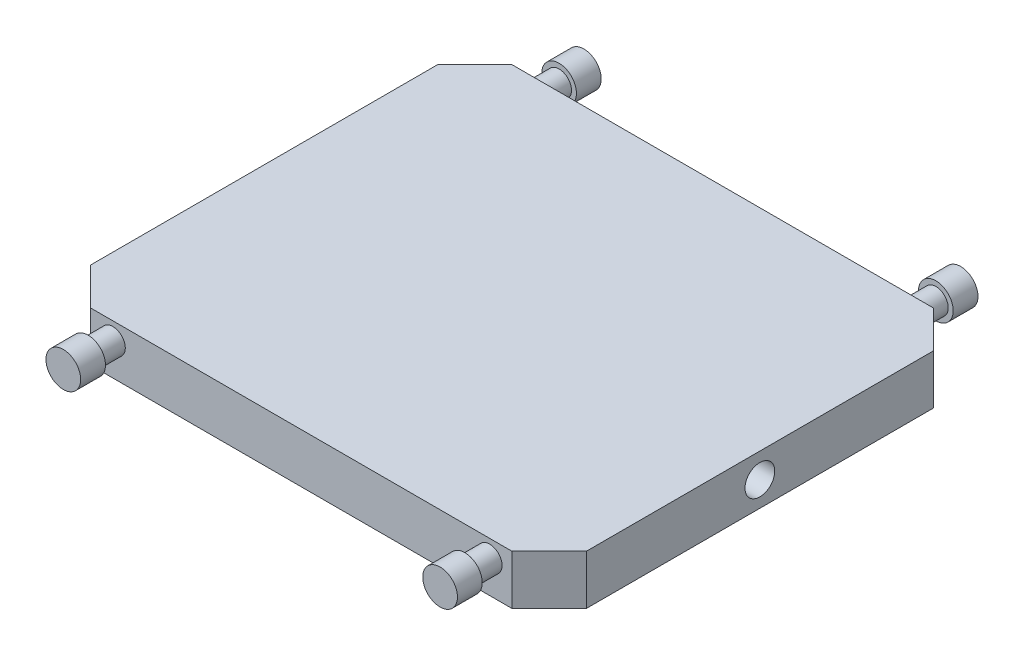
ISO-10303-21;
HEADER;
FILE_DESCRIPTION(('STEP AP214'),'2;1');
FILE_NAME('part.step','',(''),(''),'','','');
FILE_SCHEMA(('AUTOMOTIVE_DESIGN { 1 0 10303 214 1 1 1 1 }'));
ENDSEC;
DATA;
#1=APPLICATION_CONTEXT('core data for automotive mechanical design processes');
#2=APPLICATION_PROTOCOL_DEFINITION('international standard','automotive_design',2000,#1);
#3=PRODUCT_CONTEXT('',#1,'mechanical');
#4=PRODUCT('Part','Part','',(#3));
#5=PRODUCT_RELATED_PRODUCT_CATEGORY('part','',(#4));
#6=PRODUCT_DEFINITION_FORMATION('','',#4);
#7=PRODUCT_DEFINITION_CONTEXT('part definition',#1,'design');
#8=PRODUCT_DEFINITION('design','',#6,#7);
#9=PRODUCT_DEFINITION_SHAPE('','',#8);
#10=(LENGTH_UNIT() NAMED_UNIT(*) SI_UNIT(.MILLI.,.METRE.));
#11=(NAMED_UNIT(*) PLANE_ANGLE_UNIT() SI_UNIT($,.RADIAN.));
#12=(NAMED_UNIT(*) SI_UNIT($,.STERADIAN.) SOLID_ANGLE_UNIT());
#13=UNCERTAINTY_MEASURE_WITH_UNIT(LENGTH_MEASURE(1.E-05),#10,'distance_accuracy_value','');
#14=(GEOMETRIC_REPRESENTATION_CONTEXT(3) GLOBAL_UNCERTAINTY_ASSIGNED_CONTEXT((#13)) GLOBAL_UNIT_ASSIGNED_CONTEXT((#10,
#11,#12)) REPRESENTATION_CONTEXT('',''));
#15=CARTESIAN_POINT('',(0.,0.,0.));
#16=DIRECTION('',(0.,0.,1.));
#17=DIRECTION('',(1.,0.,0.));
#18=AXIS2_PLACEMENT_3D('',#15,#16,#17);
#19=CARTESIAN_POINT('',(0.,40.,-30.));
#20=DIRECTION('',(1.,0.,0.));
#21=DIRECTION('',(0.,0.,-1.));
#22=AXIS2_PLACEMENT_3D('',#19,#20,#21);
#23=PLANE('',#22);
#24=CARTESIAN_POINT('',(0.,20.,-170.));
#25=DIRECTION('',(-1.,0.,0.));
#26=DIRECTION('',(0.,0.,1.));
#27=AXIS2_PLACEMENT_3D('',#24,#25,#26);
#28=CIRCLE('',#27,12.);
#29=CARTESIAN_POINT('',(0.,20.,-158.));
#30=VERTEX_POINT('',#29);
#31=EDGE_CURVE('E190',#30,#30,#28,.T.);
#32=ORIENTED_EDGE('',*,*,#31,.F.);
#33=EDGE_LOOP('',(#32));
#34=FACE_BOUND('',#33,.T.);
#35=DIRECTION('',(0.,0.,1.));
#36=VECTOR('',#35,1.);
#37=CARTESIAN_POINT('',(0.,0.,-30.));
#38=LINE('',#37,#36);
#39=CARTESIAN_POINT('',(0.,0.,-310.));
#40=VERTEX_POINT('',#39);
#41=CARTESIAN_POINT('',(0.,0.,-30.));
#42=VERTEX_POINT('',#41);
#43=EDGE_CURVE('E129',#40,#42,#38,.T.);
#44=ORIENTED_EDGE('',*,*,#43,.T.);
#45=DIRECTION('',(0.,-1.,0.));
#46=VECTOR('',#45,1.);
#47=CARTESIAN_POINT('',(0.,40.,-30.));
#48=LINE('',#47,#46);
#49=CARTESIAN_POINT('',(0.,40.,-30.));
#50=VERTEX_POINT('',#49);
#51=EDGE_CURVE('E157',#50,#42,#48,.T.);
#52=ORIENTED_EDGE('',*,*,#51,.F.);
#53=DIRECTION('',(0.,0.,1.));
#54=VECTOR('',#53,1.);
#55=CARTESIAN_POINT('',(0.,40.,-30.));
#56=LINE('',#55,#54);
#57=CARTESIAN_POINT('',(0.,40.,-310.));
#58=VERTEX_POINT('',#57);
#59=EDGE_CURVE('E144',#58,#50,#56,.T.);
#60=ORIENTED_EDGE('',*,*,#59,.F.);
#61=DIRECTION('',(0.,-1.,0.));
#62=VECTOR('',#61,1.);
#63=CARTESIAN_POINT('',(0.,40.,-310.));
#64=LINE('',#63,#62);
#65=EDGE_CURVE('E125',#58,#40,#64,.T.);
#66=ORIENTED_EDGE('',*,*,#65,.T.);
#67=EDGE_LOOP('',(#44,#52,#60,#66));
#68=FACE_BOUND('',#67,.T.);
#69=ADVANCED_FACE('F32',(#34,#68),#23,.F.);
#70=CARTESIAN_POINT('',(0.,40.,-30.));
#71=DIRECTION('',(0.707106781186548,0.,-0.707106781186548));
#72=DIRECTION('',(-0.707106781186548,0.,-0.707106781186548));
#73=AXIS2_PLACEMENT_3D('',#70,#71,#72);
#74=PLANE('',#73);
#75=DIRECTION('',(0.707106781186547,0.,0.707106781186547));
#76=VECTOR('',#75,1.);
#77=CARTESIAN_POINT('',(0.,0.,-30.));
#78=LINE('',#77,#76);
#79=CARTESIAN_POINT('',(30.,0.,0.));
#80=VERTEX_POINT('',#79);
#81=EDGE_CURVE('E132',#42,#80,#78,.T.);
#82=ORIENTED_EDGE('',*,*,#81,.T.);
#83=DIRECTION('',(0.,-1.,0.));
#84=VECTOR('',#83,1.);
#85=CARTESIAN_POINT('',(30.,40.,0.));
#86=LINE('',#85,#84);
#87=CARTESIAN_POINT('',(30.,40.,0.));
#88=VERTEX_POINT('',#87);
#89=EDGE_CURVE('E154',#88,#80,#86,.T.);
#90=ORIENTED_EDGE('',*,*,#89,.F.);
#91=DIRECTION('',(0.707106781186547,0.,0.707106781186547));
#92=VECTOR('',#91,1.);
#93=CARTESIAN_POINT('',(0.,40.,-30.));
#94=LINE('',#93,#92);
#95=EDGE_CURVE('E92',#50,#88,#94,.T.);
#96=ORIENTED_EDGE('',*,*,#95,.F.);
#97=ORIENTED_EDGE('',*,*,#51,.T.);
#98=EDGE_LOOP('',(#82,#90,#96,#97));
#99=FACE_BOUND('',#98,.T.);
#100=ADVANCED_FACE('F167',(#99),#74,.F.);
#101=CARTESIAN_POINT('',(30.,40.,0.));
#102=DIRECTION('',(0.,0.,-1.));
#103=DIRECTION('',(-1.,0.,0.));
#104=AXIS2_PLACEMENT_3D('',#101,#102,#103);
#105=PLANE('',#104);
#106=CARTESIAN_POINT('',(352.,26.,0.));
#107=DIRECTION('',(0.,0.,-1.));
#108=DIRECTION('',(-1.,0.,0.));
#109=AXIS2_PLACEMENT_3D('',#106,#107,#108);
#110=CIRCLE('',#109,9.99999999999993);
#111=CARTESIAN_POINT('',(342.,26.,0.));
#112=VERTEX_POINT('',#111);
#113=EDGE_CURVE('E11',#112,#112,#110,.F.);
#114=ORIENTED_EDGE('',*,*,#113,.F.);
#115=EDGE_LOOP('',(#114));
#116=FACE_BOUND('',#115,.T.);
#117=CARTESIAN_POINT('',(48.,26.,0.));
#118=DIRECTION('',(0.,0.,-1.));
#119=DIRECTION('',(-1.,0.,0.));
#120=AXIS2_PLACEMENT_3D('',#117,#118,#119);
#121=CIRCLE('',#120,10.);
#122=CARTESIAN_POINT('',(38.,26.,0.));
#123=VERTEX_POINT('',#122);
#124=EDGE_CURVE('E40',#123,#123,#121,.F.);
#125=ORIENTED_EDGE('',*,*,#124,.F.);
#126=EDGE_LOOP('',(#125));
#127=FACE_BOUND('',#126,.T.);
#128=DIRECTION('',(1.,0.,0.));
#129=VECTOR('',#128,1.);
#130=CARTESIAN_POINT('',(30.,0.,0.));
#131=LINE('',#130,#129);
#132=CARTESIAN_POINT('',(370.,0.,0.));
#133=VERTEX_POINT('',#132);
#134=EDGE_CURVE('E135',#80,#133,#131,.T.);
#135=ORIENTED_EDGE('',*,*,#134,.T.);
#136=DIRECTION('',(0.,-1.,0.));
#137=VECTOR('',#136,1.);
#138=CARTESIAN_POINT('',(370.,40.,0.));
#139=LINE('',#138,#137);
#140=CARTESIAN_POINT('',(370.,40.,0.));
#141=VERTEX_POINT('',#140);
#142=EDGE_CURVE('E151',#141,#133,#139,.T.);
#143=ORIENTED_EDGE('',*,*,#142,.F.);
#144=DIRECTION('',(1.,0.,0.));
#145=VECTOR('',#144,1.);
#146=CARTESIAN_POINT('',(30.,40.,0.));
#147=LINE('',#146,#145);
#148=EDGE_CURVE('E184',#88,#141,#147,.T.);
#149=ORIENTED_EDGE('',*,*,#148,.F.);
#150=ORIENTED_EDGE('',*,*,#89,.T.);
#151=EDGE_LOOP('',(#135,#143,#149,#150));
#152=FACE_BOUND('',#151,.T.);
#153=ADVANCED_FACE('F163',(#116,#127,#152),#105,.F.);
#154=CARTESIAN_POINT('',(370.,40.,0.));
#155=DIRECTION('',(-0.707106781186547,0.,-0.707106781186548));
#156=DIRECTION('',(-0.707106781186548,0.,0.707106781186547));
#157=AXIS2_PLACEMENT_3D('',#154,#155,#156);
#158=PLANE('',#157);
#159=DIRECTION('',(0.707106781186548,0.,-0.707106781186547));
#160=VECTOR('',#159,1.);
#161=CARTESIAN_POINT('',(370.,0.,0.));
#162=LINE('',#161,#160);
#163=CARTESIAN_POINT('',(400.,0.,-30.));
#164=VERTEX_POINT('',#163);
#165=EDGE_CURVE('E137',#133,#164,#162,.T.);
#166=ORIENTED_EDGE('',*,*,#165,.T.);
#167=DIRECTION('',(0.,-1.,0.));
#168=VECTOR('',#167,1.);
#169=CARTESIAN_POINT('',(400.,40.,-30.));
#170=LINE('',#169,#168);
#171=CARTESIAN_POINT('',(400.,40.,-30.));
#172=VERTEX_POINT('',#171);
#173=EDGE_CURVE('E148',#172,#164,#170,.T.);
#174=ORIENTED_EDGE('',*,*,#173,.F.);
#175=DIRECTION('',(0.707106781186548,0.,-0.707106781186547));
#176=VECTOR('',#175,1.);
#177=CARTESIAN_POINT('',(370.,40.,0.));
#178=LINE('',#177,#176);
#179=EDGE_CURVE('E178',#141,#172,#178,.T.);
#180=ORIENTED_EDGE('',*,*,#179,.F.);
#181=ORIENTED_EDGE('',*,*,#142,.T.);
#182=EDGE_LOOP('',(#166,#174,#180,#181));
#183=FACE_BOUND('',#182,.T.);
#184=ADVANCED_FACE('F166',(#183),#158,.F.);
#185=CARTESIAN_POINT('',(400.,40.,-30.));
#186=DIRECTION('',(-1.,0.,0.));
#187=DIRECTION('',(0.,0.,1.));
#188=AXIS2_PLACEMENT_3D('',#185,#186,#187);
#189=PLANE('',#188);
#190=CARTESIAN_POINT('',(400.,20.,-170.));
#191=DIRECTION('',(-1.,0.,0.));
#192=DIRECTION('',(0.,0.,1.));
#193=AXIS2_PLACEMENT_3D('',#190,#191,#192);
#194=CIRCLE('',#193,12.);
#195=CARTESIAN_POINT('',(400.,20.,-158.));
#196=VERTEX_POINT('',#195);
#197=EDGE_CURVE('E133',#196,#196,#194,.T.);
#198=ORIENTED_EDGE('',*,*,#197,.T.);
#199=EDGE_LOOP('',(#198));
#200=FACE_BOUND('',#199,.T.);
#201=DIRECTION('',(0.,0.,-1.));
#202=VECTOR('',#201,1.);
#203=CARTESIAN_POINT('',(400.,0.,-30.));
#204=LINE('',#203,#202);
#205=CARTESIAN_POINT('',(400.,0.,-310.));
#206=VERTEX_POINT('',#205);
#207=EDGE_CURVE('E139',#164,#206,#204,.T.);
#208=ORIENTED_EDGE('',*,*,#207,.T.);
#209=DIRECTION('',(0.,-1.,0.));
#210=VECTOR('',#209,1.);
#211=CARTESIAN_POINT('',(400.,40.,-310.));
#212=LINE('',#211,#210);
#213=CARTESIAN_POINT('',(400.,40.,-310.));
#214=VERTEX_POINT('',#213);
#215=EDGE_CURVE('E120',#214,#206,#212,.T.);
#216=ORIENTED_EDGE('',*,*,#215,.F.);
#217=DIRECTION('',(0.,0.,-1.));
#218=VECTOR('',#217,1.);
#219=CARTESIAN_POINT('',(400.,40.,-30.));
#220=LINE('',#219,#218);
#221=EDGE_CURVE('E111',#172,#214,#220,.T.);
#222=ORIENTED_EDGE('',*,*,#221,.F.);
#223=ORIENTED_EDGE('',*,*,#173,.T.);
#224=EDGE_LOOP('',(#208,#216,#222,#223));
#225=FACE_BOUND('',#224,.T.);
#226=ADVANCED_FACE('F183',(#200,#225),#189,.F.);
#227=CARTESIAN_POINT('',(370.,40.,-340.));
#228=DIRECTION('',(-0.707106781186547,0.,0.707106781186548));
#229=DIRECTION('',(0.707106781186548,0.,0.707106781186547));
#230=AXIS2_PLACEMENT_3D('',#227,#228,#229);
#231=PLANE('',#230);
#232=DIRECTION('',(-0.707106781186548,0.,-0.707106781186547));
#233=VECTOR('',#232,1.);
#234=CARTESIAN_POINT('',(370.,0.,-340.));
#235=LINE('',#234,#233);
#236=CARTESIAN_POINT('',(370.,0.,-340.));
#237=VERTEX_POINT('',#236);
#238=EDGE_CURVE('E119',#206,#237,#235,.T.);
#239=ORIENTED_EDGE('',*,*,#238,.T.);
#240=DIRECTION('',(0.,-1.,0.));
#241=VECTOR('',#240,1.);
#242=CARTESIAN_POINT('',(370.,40.,-340.));
#243=LINE('',#242,#241);
#244=CARTESIAN_POINT('',(370.,40.,-340.));
#245=VERTEX_POINT('',#244);
#246=EDGE_CURVE('E116',#245,#237,#243,.T.);
#247=ORIENTED_EDGE('',*,*,#246,.F.);
#248=DIRECTION('',(-0.707106781186548,0.,-0.707106781186547));
#249=VECTOR('',#248,1.);
#250=CARTESIAN_POINT('',(370.,40.,-340.));
#251=LINE('',#250,#249);
#252=EDGE_CURVE('E105',#214,#245,#251,.T.);
#253=ORIENTED_EDGE('',*,*,#252,.F.);
#254=ORIENTED_EDGE('',*,*,#215,.T.);
#255=EDGE_LOOP('',(#239,#247,#253,#254));
#256=FACE_BOUND('',#255,.T.);
#257=ADVANCED_FACE('F117',(#256),#231,.F.);
#258=CARTESIAN_POINT('',(30.,40.,-340.));
#259=DIRECTION('',(0.,0.,1.));
#260=DIRECTION('',(1.,0.,0.));
#261=AXIS2_PLACEMENT_3D('',#258,#259,#260);
#262=PLANE('',#261);
#263=CARTESIAN_POINT('',(352.,26.,-340.));
#264=DIRECTION('',(0.,0.,1.));
#265=DIRECTION('',(-1.,0.,0.));
#266=AXIS2_PLACEMENT_3D('',#263,#264,#265);
#267=CIRCLE('',#266,9.99999999999993);
#268=CARTESIAN_POINT('',(342.,26.,-340.));
#269=VERTEX_POINT('',#268);
#270=EDGE_CURVE('E216',#269,#269,#267,.T.);
#271=ORIENTED_EDGE('',*,*,#270,.T.);
#272=EDGE_LOOP('',(#271));
#273=FACE_BOUND('',#272,.T.);
#274=CARTESIAN_POINT('',(48.,26.,-340.));
#275=DIRECTION('',(0.,0.,1.));
#276=DIRECTION('',(1.,0.,0.));
#277=AXIS2_PLACEMENT_3D('',#274,#275,#276);
#278=CIRCLE('',#277,10.);
#279=CARTESIAN_POINT('',(58.,26.,-340.));
#280=VERTEX_POINT('',#279);
#281=EDGE_CURVE('E211',#280,#280,#278,.T.);
#282=ORIENTED_EDGE('',*,*,#281,.T.);
#283=EDGE_LOOP('',(#282));
#284=FACE_BOUND('',#283,.T.);
#285=DIRECTION('',(-1.,0.,0.));
#286=VECTOR('',#285,1.);
#287=CARTESIAN_POINT('',(30.,0.,-340.));
#288=LINE('',#287,#286);
#289=CARTESIAN_POINT('',(30.,0.,-340.));
#290=VERTEX_POINT('',#289);
#291=EDGE_CURVE('E77',#237,#290,#288,.T.);
#292=ORIENTED_EDGE('',*,*,#291,.T.);
#293=DIRECTION('',(0.,-1.,0.));
#294=VECTOR('',#293,1.);
#295=CARTESIAN_POINT('',(30.,40.,-340.));
#296=LINE('',#295,#294);
#297=CARTESIAN_POINT('',(30.,40.,-340.));
#298=VERTEX_POINT('',#297);
#299=EDGE_CURVE('E121',#298,#290,#296,.T.);
#300=ORIENTED_EDGE('',*,*,#299,.F.);
#301=DIRECTION('',(-1.,0.,0.));
#302=VECTOR('',#301,1.);
#303=CARTESIAN_POINT('',(30.,40.,-340.));
#304=LINE('',#303,#302);
#305=EDGE_CURVE('E109',#245,#298,#304,.T.);
#306=ORIENTED_EDGE('',*,*,#305,.F.);
#307=ORIENTED_EDGE('',*,*,#246,.T.);
#308=EDGE_LOOP('',(#292,#300,#306,#307));
#309=FACE_BOUND('',#308,.T.);
#310=ADVANCED_FACE('F123',(#273,#284,#309),#262,.F.);
#311=CARTESIAN_POINT('',(0.,40.,-310.));
#312=DIRECTION('',(0.707106781186547,0.,0.707106781186548));
#313=DIRECTION('',(0.707106781186548,0.,-0.707106781186547));
#314=AXIS2_PLACEMENT_3D('',#311,#312,#313);
#315=PLANE('',#314);
#316=DIRECTION('',(-0.707106781186548,0.,0.707106781186547));
#317=VECTOR('',#316,1.);
#318=CARTESIAN_POINT('',(0.,0.,-310.));
#319=LINE('',#318,#317);
#320=EDGE_CURVE('E83',#290,#40,#319,.T.);
#321=ORIENTED_EDGE('',*,*,#320,.T.);
#322=ORIENTED_EDGE('',*,*,#65,.F.);
#323=DIRECTION('',(-0.707106781186548,0.,0.707106781186547));
#324=VECTOR('',#323,1.);
#325=CARTESIAN_POINT('',(0.,40.,-310.));
#326=LINE('',#325,#324);
#327=EDGE_CURVE('E48',#298,#58,#326,.T.);
#328=ORIENTED_EDGE('',*,*,#327,.F.);
#329=ORIENTED_EDGE('',*,*,#299,.T.);
#330=EDGE_LOOP('',(#321,#322,#328,#329));
#331=FACE_BOUND('',#330,.T.);
#332=ADVANCED_FACE('F262',(#331),#315,.F.);
#333=CARTESIAN_POINT('',(0.,40.,0.));
#334=DIRECTION('',(0.,-1.,0.));
#335=DIRECTION('',(0.,0.,-1.));
#336=AXIS2_PLACEMENT_3D('',#333,#334,#335);
#337=PLANE('',#336);
#338=ORIENTED_EDGE('',*,*,#59,.T.);
#339=ORIENTED_EDGE('',*,*,#95,.T.);
#340=ORIENTED_EDGE('',*,*,#148,.T.);
#341=ORIENTED_EDGE('',*,*,#179,.T.);
#342=ORIENTED_EDGE('',*,*,#221,.T.);
#343=ORIENTED_EDGE('',*,*,#252,.T.);
#344=ORIENTED_EDGE('',*,*,#305,.T.);
#345=ORIENTED_EDGE('',*,*,#327,.T.);
#346=EDGE_LOOP('',(#338,#339,#340,#341,#342,#343,#344,#345));
#347=FACE_BOUND('',#346,.T.);
#348=ADVANCED_FACE('F107',(#347),#337,.F.);
#349=CARTESIAN_POINT('',(0.,0.,0.));
#350=DIRECTION('',(0.,-1.,0.));
#351=DIRECTION('',(0.,0.,-1.));
#352=AXIS2_PLACEMENT_3D('',#349,#350,#351);
#353=PLANE('',#352);
#354=ORIENTED_EDGE('',*,*,#43,.F.);
#355=ORIENTED_EDGE('',*,*,#320,.F.);
#356=ORIENTED_EDGE('',*,*,#291,.F.);
#357=ORIENTED_EDGE('',*,*,#238,.F.);
#358=ORIENTED_EDGE('',*,*,#207,.F.);
#359=ORIENTED_EDGE('',*,*,#165,.F.);
#360=ORIENTED_EDGE('',*,*,#134,.F.);
#361=ORIENTED_EDGE('',*,*,#81,.F.);
#362=EDGE_LOOP('',(#354,#355,#356,#357,#358,#359,#360,#361));
#363=FACE_BOUND('',#362,.T.);
#364=ADVANCED_FACE('F181',(#363),#353,.T.);
#365=CARTESIAN_POINT('',(400.,20.,-170.));
#366=DIRECTION('',(-1.,0.,0.));
#367=DIRECTION('',(0.,0.,1.));
#368=AXIS2_PLACEMENT_3D('',#365,#366,#367);
#369=CYLINDRICAL_SURFACE('',#368,12.);
#370=ORIENTED_EDGE('',*,*,#197,.F.);
#371=EDGE_LOOP('',(#370));
#372=FACE_BOUND('',#371,.T.);
#373=ORIENTED_EDGE('',*,*,#31,.T.);
#374=EDGE_LOOP('',(#373));
#375=FACE_BOUND('',#374,.T.);
#376=ADVANCED_FACE('F405',(#372,#375),#369,.F.);
#377=CARTESIAN_POINT('',(48.,26.,20.));
#378=DIRECTION('',(0.,0.,-1.));
#379=DIRECTION('',(-1.,0.,0.));
#380=AXIS2_PLACEMENT_3D('',#377,#378,#379);
#381=CYLINDRICAL_SURFACE('',#380,10.);
#382=CARTESIAN_POINT('',(48.,26.,20.));
#383=DIRECTION('',(0.,0.,1.));
#384=DIRECTION('',(1.,0.,0.));
#385=AXIS2_PLACEMENT_3D('',#382,#383,#384);
#386=CIRCLE('',#385,10.);
#387=CARTESIAN_POINT('',(58.,26.,20.));
#388=VERTEX_POINT('',#387);
#389=EDGE_CURVE('E193',#388,#388,#386,.T.);
#390=ORIENTED_EDGE('',*,*,#389,.F.);
#391=EDGE_LOOP('',(#390));
#392=FACE_BOUND('',#391,.T.);
#393=ORIENTED_EDGE('',*,*,#124,.T.);
#394=EDGE_LOOP('',(#393));
#395=FACE_BOUND('',#394,.T.);
#396=ADVANCED_FACE('F161',(#392,#395),#381,.T.);
#397=CARTESIAN_POINT('',(352.,26.,20.));
#398=DIRECTION('',(0.,0.,-1.));
#399=DIRECTION('',(-1.,0.,0.));
#400=AXIS2_PLACEMENT_3D('',#397,#398,#399);
#401=CYLINDRICAL_SURFACE('',#400,9.99999999999993);
#402=CARTESIAN_POINT('',(352.,26.,20.));
#403=DIRECTION('',(0.,0.,1.));
#404=DIRECTION('',(-1.,0.,0.));
#405=AXIS2_PLACEMENT_3D('',#402,#403,#404);
#406=CIRCLE('',#405,9.99999999999993);
#407=CARTESIAN_POINT('',(342.,26.,20.));
#408=VERTEX_POINT('',#407);
#409=EDGE_CURVE('E198',#408,#408,#406,.T.);
#410=ORIENTED_EDGE('',*,*,#409,.F.);
#411=EDGE_LOOP('',(#410));
#412=FACE_BOUND('',#411,.T.);
#413=ORIENTED_EDGE('',*,*,#113,.T.);
#414=EDGE_LOOP('',(#413));
#415=FACE_BOUND('',#414,.T.);
#416=ADVANCED_FACE('F398',(#412,#415),#401,.T.);
#417=CARTESIAN_POINT('',(48.,26.,40.));
#418=DIRECTION('',(0.,0.,-1.));
#419=DIRECTION('',(-1.,0.,0.));
#420=AXIS2_PLACEMENT_3D('',#417,#418,#419);
#421=CYLINDRICAL_SURFACE('',#420,14.);
#422=CARTESIAN_POINT('',(48.,26.,40.));
#423=DIRECTION('',(0.,0.,1.));
#424=DIRECTION('',(1.,0.,0.));
#425=AXIS2_PLACEMENT_3D('',#422,#423,#424);
#426=CIRCLE('',#425,14.);
#427=CARTESIAN_POINT('',(62.,26.,40.));
#428=VERTEX_POINT('',#427);
#429=EDGE_CURVE('E201',#428,#428,#426,.T.);
#430=ORIENTED_EDGE('',*,*,#429,.F.);
#431=EDGE_LOOP('',(#430));
#432=FACE_BOUND('',#431,.T.);
#433=CARTESIAN_POINT('',(48.,26.,20.));
#434=DIRECTION('',(0.,0.,1.));
#435=DIRECTION('',(1.,0.,0.));
#436=AXIS2_PLACEMENT_3D('',#433,#434,#435);
#437=CIRCLE('',#436,14.);
#438=CARTESIAN_POINT('',(62.,26.,20.));
#439=VERTEX_POINT('',#438);
#440=EDGE_CURVE('E202',#439,#439,#437,.T.);
#441=ORIENTED_EDGE('',*,*,#440,.T.);
#442=EDGE_LOOP('',(#441));
#443=FACE_BOUND('',#442,.T.);
#444=ADVANCED_FACE('F391',(#432,#443),#421,.T.);
#445=CARTESIAN_POINT('',(48.,26.,40.));
#446=DIRECTION('',(0.,0.,1.));
#447=DIRECTION('',(1.,0.,0.));
#448=AXIS2_PLACEMENT_3D('',#445,#446,#447);
#449=PLANE('',#448);
#450=ORIENTED_EDGE('',*,*,#429,.T.);
#451=EDGE_LOOP('',(#450));
#452=FACE_BOUND('',#451,.T.);
#453=ADVANCED_FACE('F388',(#452),#449,.T.);
#454=CARTESIAN_POINT('',(48.,26.,20.));
#455=DIRECTION('',(0.,0.,1.));
#456=DIRECTION('',(1.,0.,0.));
#457=AXIS2_PLACEMENT_3D('',#454,#455,#456);
#458=PLANE('',#457);
#459=ORIENTED_EDGE('',*,*,#389,.T.);
#460=EDGE_LOOP('',(#459));
#461=FACE_BOUND('',#460,.T.);
#462=ORIENTED_EDGE('',*,*,#440,.F.);
#463=EDGE_LOOP('',(#462));
#464=FACE_BOUND('',#463,.T.);
#465=ADVANCED_FACE('F386',(#461,#464),#458,.F.);
#466=CARTESIAN_POINT('',(352.,26.,40.));
#467=DIRECTION('',(0.,0.,-1.));
#468=DIRECTION('',(-1.,0.,0.));
#469=AXIS2_PLACEMENT_3D('',#466,#467,#468);
#470=CYLINDRICAL_SURFACE('',#469,14.);
#471=CARTESIAN_POINT('',(352.,26.,40.));
#472=DIRECTION('',(0.,0.,1.));
#473=DIRECTION('',(1.,0.,0.));
#474=AXIS2_PLACEMENT_3D('',#471,#472,#473);
#475=CIRCLE('',#474,14.);
#476=CARTESIAN_POINT('',(366.,26.,40.));
#477=VERTEX_POINT('',#476);
#478=EDGE_CURVE('E205',#477,#477,#475,.T.);
#479=ORIENTED_EDGE('',*,*,#478,.F.);
#480=EDGE_LOOP('',(#479));
#481=FACE_BOUND('',#480,.T.);
#482=CARTESIAN_POINT('',(352.,26.,20.));
#483=DIRECTION('',(0.,0.,1.));
#484=DIRECTION('',(1.,0.,0.));
#485=AXIS2_PLACEMENT_3D('',#482,#483,#484);
#486=CIRCLE('',#485,14.);
#487=CARTESIAN_POINT('',(366.,26.,20.));
#488=VERTEX_POINT('',#487);
#489=EDGE_CURVE('E208',#488,#488,#486,.T.);
#490=ORIENTED_EDGE('',*,*,#489,.T.);
#491=EDGE_LOOP('',(#490));
#492=FACE_BOUND('',#491,.T.);
#493=ADVANCED_FACE('F380',(#481,#492),#470,.T.);
#494=CARTESIAN_POINT('',(352.,26.,40.));
#495=DIRECTION('',(0.,0.,1.));
#496=DIRECTION('',(1.,0.,0.));
#497=AXIS2_PLACEMENT_3D('',#494,#495,#496);
#498=PLANE('',#497);
#499=ORIENTED_EDGE('',*,*,#478,.T.);
#500=EDGE_LOOP('',(#499));
#501=FACE_BOUND('',#500,.T.);
#502=ADVANCED_FACE('F377',(#501),#498,.T.);
#503=CARTESIAN_POINT('',(352.,26.,20.));
#504=DIRECTION('',(0.,0.,1.));
#505=DIRECTION('',(1.,0.,0.));
#506=AXIS2_PLACEMENT_3D('',#503,#504,#505);
#507=PLANE('',#506);
#508=ORIENTED_EDGE('',*,*,#409,.T.);
#509=EDGE_LOOP('',(#508));
#510=FACE_BOUND('',#509,.T.);
#511=ORIENTED_EDGE('',*,*,#489,.F.);
#512=EDGE_LOOP('',(#511));
#513=FACE_BOUND('',#512,.T.);
#514=ADVANCED_FACE('F305',(#510,#513),#507,.F.);
#515=CARTESIAN_POINT('',(48.,26.,-360.));
#516=DIRECTION('',(0.,0.,1.));
#517=DIRECTION('',(1.,0.,0.));
#518=AXIS2_PLACEMENT_3D('',#515,#516,#517);
#519=CYLINDRICAL_SURFACE('',#518,10.);
#520=CARTESIAN_POINT('',(48.,26.,-360.));
#521=DIRECTION('',(0.,0.,-1.));
#522=DIRECTION('',(-1.,0.,0.));
#523=AXIS2_PLACEMENT_3D('',#520,#521,#522);
#524=CIRCLE('',#523,10.);
#525=CARTESIAN_POINT('',(38.,26.,-360.));
#526=VERTEX_POINT('',#525);
#527=EDGE_CURVE('E219',#526,#526,#524,.F.);
#528=ORIENTED_EDGE('',*,*,#527,.T.);
#529=EDGE_LOOP('',(#528));
#530=FACE_BOUND('',#529,.T.);
#531=ORIENTED_EDGE('',*,*,#281,.F.);
#532=EDGE_LOOP('',(#531));
#533=FACE_BOUND('',#532,.T.);
#534=ADVANCED_FACE('F310',(#530,#533),#519,.T.);
#535=CARTESIAN_POINT('',(352.,26.,-360.));
#536=DIRECTION('',(0.,0.,1.));
#537=DIRECTION('',(1.,0.,0.));
#538=AXIS2_PLACEMENT_3D('',#535,#536,#537);
#539=CYLINDRICAL_SURFACE('',#538,9.99999999999993);
#540=CARTESIAN_POINT('',(352.,26.,-360.));
#541=DIRECTION('',(0.,0.,-1.));
#542=DIRECTION('',(-1.,0.,0.));
#543=AXIS2_PLACEMENT_3D('',#540,#541,#542);
#544=CIRCLE('',#543,9.99999999999993);
#545=CARTESIAN_POINT('',(342.,26.,-360.));
#546=VERTEX_POINT('',#545);
#547=EDGE_CURVE('E226',#546,#546,#544,.F.);
#548=ORIENTED_EDGE('',*,*,#547,.T.);
#549=EDGE_LOOP('',(#548));
#550=FACE_BOUND('',#549,.T.);
#551=ORIENTED_EDGE('',*,*,#270,.F.);
#552=EDGE_LOOP('',(#551));
#553=FACE_BOUND('',#552,.T.);
#554=ADVANCED_FACE('F315',(#550,#553),#539,.T.);
#555=CARTESIAN_POINT('',(48.,26.,-380.));
#556=DIRECTION('',(0.,0.,1.));
#557=DIRECTION('',(1.,0.,0.));
#558=AXIS2_PLACEMENT_3D('',#555,#556,#557);
#559=CYLINDRICAL_SURFACE('',#558,14.);
#560=CARTESIAN_POINT('',(48.,26.,-380.));
#561=DIRECTION('',(0.,0.,1.));
#562=DIRECTION('',(1.,0.,0.));
#563=AXIS2_PLACEMENT_3D('',#560,#561,#562);
#564=CIRCLE('',#563,14.);
#565=CARTESIAN_POINT('',(62.,26.,-380.));
#566=VERTEX_POINT('',#565);
#567=EDGE_CURVE('E222',#566,#566,#564,.T.);
#568=ORIENTED_EDGE('',*,*,#567,.T.);
#569=EDGE_LOOP('',(#568));
#570=FACE_BOUND('',#569,.T.);
#571=CARTESIAN_POINT('',(48.,26.,-360.));
#572=DIRECTION('',(0.,0.,1.));
#573=DIRECTION('',(1.,0.,0.));
#574=AXIS2_PLACEMENT_3D('',#571,#572,#573);
#575=CIRCLE('',#574,14.);
#576=CARTESIAN_POINT('',(62.,26.,-360.));
#577=VERTEX_POINT('',#576);
#578=EDGE_CURVE('E223',#577,#577,#575,.T.);
#579=ORIENTED_EDGE('',*,*,#578,.F.);
#580=EDGE_LOOP('',(#579));
#581=FACE_BOUND('',#580,.T.);
#582=ADVANCED_FACE('F325',(#570,#581),#559,.T.);
#583=CARTESIAN_POINT('',(48.,26.,-380.));
#584=DIRECTION('',(0.,0.,-1.));
#585=DIRECTION('',(1.,0.,0.));
#586=AXIS2_PLACEMENT_3D('',#583,#584,#585);
#587=PLANE('',#586);
#588=ORIENTED_EDGE('',*,*,#567,.F.);
#589=EDGE_LOOP('',(#588));
#590=FACE_BOUND('',#589,.T.);
#591=ADVANCED_FACE('F335',(#590),#587,.T.);
#592=CARTESIAN_POINT('',(48.,26.,-360.));
#593=DIRECTION('',(0.,0.,-1.));
#594=DIRECTION('',(1.,0.,0.));
#595=AXIS2_PLACEMENT_3D('',#592,#593,#594);
#596=PLANE('',#595);
#597=ORIENTED_EDGE('',*,*,#527,.F.);
#598=EDGE_LOOP('',(#597));
#599=FACE_BOUND('',#598,.T.);
#600=ORIENTED_EDGE('',*,*,#578,.T.);
#601=EDGE_LOOP('',(#600));
#602=FACE_BOUND('',#601,.T.);
#603=ADVANCED_FACE('F251',(#599,#602),#596,.F.);
#604=CARTESIAN_POINT('',(352.,26.,-380.));
#605=DIRECTION('',(0.,0.,1.));
#606=DIRECTION('',(1.,0.,0.));
#607=AXIS2_PLACEMENT_3D('',#604,#605,#606);
#608=CYLINDRICAL_SURFACE('',#607,14.);
#609=CARTESIAN_POINT('',(352.,26.,-380.));
#610=DIRECTION('',(0.,0.,1.));
#611=DIRECTION('',(1.,0.,0.));
#612=AXIS2_PLACEMENT_3D('',#609,#610,#611);
#613=CIRCLE('',#612,14.);
#614=CARTESIAN_POINT('',(366.,26.,-380.));
#615=VERTEX_POINT('',#614);
#616=EDGE_CURVE('E231',#615,#615,#613,.T.);
#617=ORIENTED_EDGE('',*,*,#616,.T.);
#618=EDGE_LOOP('',(#617));
#619=FACE_BOUND('',#618,.T.);
#620=CARTESIAN_POINT('',(352.,26.,-360.));
#621=DIRECTION('',(0.,0.,1.));
#622=DIRECTION('',(1.,0.,0.));
#623=AXIS2_PLACEMENT_3D('',#620,#621,#622);
#624=CIRCLE('',#623,14.);
#625=CARTESIAN_POINT('',(366.,26.,-360.));
#626=VERTEX_POINT('',#625);
#627=EDGE_CURVE('E232',#626,#626,#624,.T.);
#628=ORIENTED_EDGE('',*,*,#627,.F.);
#629=EDGE_LOOP('',(#628));
#630=FACE_BOUND('',#629,.T.);
#631=ADVANCED_FACE('F238',(#619,#630),#608,.T.);
#632=CARTESIAN_POINT('',(352.,26.,-380.));
#633=DIRECTION('',(0.,0.,-1.));
#634=DIRECTION('',(1.,0.,0.));
#635=AXIS2_PLACEMENT_3D('',#632,#633,#634);
#636=PLANE('',#635);
#637=ORIENTED_EDGE('',*,*,#616,.F.);
#638=EDGE_LOOP('',(#637));
#639=FACE_BOUND('',#638,.T.);
#640=ADVANCED_FACE('F241',(#639),#636,.T.);
#641=CARTESIAN_POINT('',(352.,26.,-360.));
#642=DIRECTION('',(0.,0.,-1.));
#643=DIRECTION('',(1.,0.,0.));
#644=AXIS2_PLACEMENT_3D('',#641,#642,#643);
#645=PLANE('',#644);
#646=ORIENTED_EDGE('',*,*,#547,.F.);
#647=EDGE_LOOP('',(#646));
#648=FACE_BOUND('',#647,.T.);
#649=ORIENTED_EDGE('',*,*,#627,.T.);
#650=EDGE_LOOP('',(#649));
#651=FACE_BOUND('',#650,.T.);
#652=ADVANCED_FACE('F243',(#648,#651),#645,.F.);
#653=CLOSED_SHELL('',(#69,#100,#153,#184,#226,#257,#310,#332,#348,#364,#376,#396,#416,#444,#453,
#465,#493,#502,#514,#534,#554,#582,#591,#603,#631,#640,#652));
#654=MANIFOLD_SOLID_BREP('B2',#653);
#655=ADVANCED_BREP_SHAPE_REPRESENTATION('',(#18,#654),#14);
#656=SHAPE_DEFINITION_REPRESENTATION(#9,#655);
ENDSEC;
END-ISO-10303-21;
